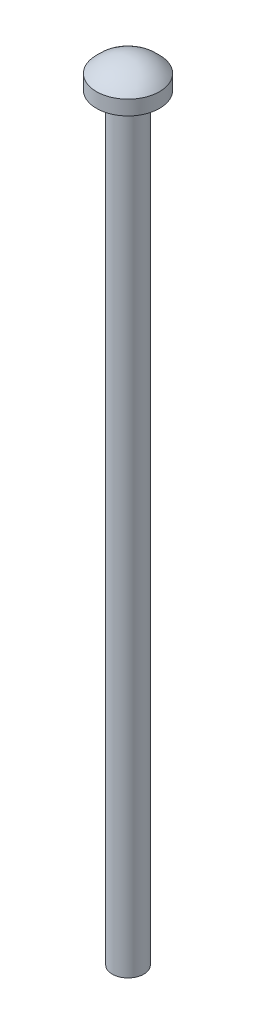
ISO-10303-21;
HEADER;
FILE_DESCRIPTION(('STEP AP214'),'2;1');
FILE_NAME('part.step','',(''),(''),'','','');
FILE_SCHEMA(('AUTOMOTIVE_DESIGN { 1 0 10303 214 1 1 1 1 }'));
ENDSEC;
DATA;
#1=APPLICATION_CONTEXT('core data for automotive mechanical design processes');
#2=APPLICATION_PROTOCOL_DEFINITION('international standard','automotive_design',2000,#1);
#3=PRODUCT_CONTEXT('',#1,'mechanical');
#4=PRODUCT('Part','Part','',(#3));
#5=PRODUCT_RELATED_PRODUCT_CATEGORY('part','',(#4));
#6=PRODUCT_DEFINITION_FORMATION('','',#4);
#7=PRODUCT_DEFINITION_CONTEXT('part definition',#1,'design');
#8=PRODUCT_DEFINITION('design','',#6,#7);
#9=PRODUCT_DEFINITION_SHAPE('','',#8);
#10=(LENGTH_UNIT() NAMED_UNIT(*) SI_UNIT(.MILLI.,.METRE.));
#11=(NAMED_UNIT(*) PLANE_ANGLE_UNIT() SI_UNIT($,.RADIAN.));
#12=(NAMED_UNIT(*) SI_UNIT($,.STERADIAN.) SOLID_ANGLE_UNIT());
#13=UNCERTAINTY_MEASURE_WITH_UNIT(LENGTH_MEASURE(1.E-05),#10,'distance_accuracy_value','');
#14=(GEOMETRIC_REPRESENTATION_CONTEXT(3) GLOBAL_UNCERTAINTY_ASSIGNED_CONTEXT((#13)) GLOBAL_UNIT_ASSIGNED_CONTEXT((#10,
#11,#12)) REPRESENTATION_CONTEXT('',''));
#15=CARTESIAN_POINT('',(0.,0.,0.));
#16=DIRECTION('',(0.,0.,1.));
#17=DIRECTION('',(1.,0.,0.));
#18=AXIS2_PLACEMENT_3D('',#15,#16,#17);
#19=CARTESIAN_POINT('',(0.,-49.3995287745686,0.));
#20=DIRECTION('',(0.,1.,0.));
#21=DIRECTION('',(0.,0.,1.));
#22=AXIS2_PLACEMENT_3D('',#19,#20,#21);
#23=PLANE('',#22);
#24=CARTESIAN_POINT('',(0.,-49.3995287745686,0.));
#25=DIRECTION('',(0.,-1.,0.));
#26=DIRECTION('',(0.,0.,-1.));
#27=AXIS2_PLACEMENT_3D('',#24,#25,#26);
#28=CIRCLE('',#27,1.5875);
#29=CARTESIAN_POINT('',(0.,-49.3995287745686,-1.5875));
#30=VERTEX_POINT('',#29);
#31=EDGE_CURVE('E10',#30,#30,#28,.T.);
#32=ORIENTED_EDGE('',*,*,#31,.T.);
#33=EDGE_LOOP('',(#32));
#34=FACE_BOUND('',#33,.T.);
#35=ADVANCED_FACE('F32',(#34),#23,.F.);
#36=CARTESIAN_POINT('',(0.,-49.3995287745686,0.));
#37=DIRECTION('',(0.,-1.,0.));
#38=DIRECTION('',(0.,0.,-1.));
#39=AXIS2_PLACEMENT_3D('',#36,#37,#38);
#40=CYLINDRICAL_SURFACE('',#39,1.5875);
#41=ORIENTED_EDGE('',*,*,#31,.F.);
#42=EDGE_LOOP('',(#41));
#43=FACE_BOUND('',#42,.T.);
#44=CARTESIAN_POINT('',(0.,26.8004712254314,0.));
#45=DIRECTION('',(0.,-1.,0.));
#46=DIRECTION('',(0.,0.,-1.));
#47=AXIS2_PLACEMENT_3D('',#44,#45,#46);
#48=CIRCLE('',#47,1.5875);
#49=CARTESIAN_POINT('',(0.,26.8004712254314,-1.5875));
#50=VERTEX_POINT('',#49);
#51=EDGE_CURVE('E38',#50,#50,#48,.T.);
#52=ORIENTED_EDGE('',*,*,#51,.T.);
#53=EDGE_LOOP('',(#52));
#54=FACE_BOUND('',#53,.T.);
#55=ADVANCED_FACE('F64',(#43,#54),#40,.T.);
#56=CARTESIAN_POINT('',(0.,26.8004712254314,1.5875));
#57=DIRECTION('',(0.,1.,0.));
#58=DIRECTION('',(0.,0.,1.));
#59=AXIS2_PLACEMENT_3D('',#56,#57,#58);
#60=PLANE('',#59);
#61=ORIENTED_EDGE('',*,*,#51,.F.);
#62=EDGE_LOOP('',(#61));
#63=FACE_BOUND('',#62,.T.);
#64=CARTESIAN_POINT('',(0.,26.8004712254314,0.));
#65=DIRECTION('',(0.,-1.,0.));
#66=DIRECTION('',(0.,0.,-1.));
#67=AXIS2_PLACEMENT_3D('',#64,#65,#66);
#68=CIRCLE('',#67,3.175);
#69=CARTESIAN_POINT('',(0.,26.8004712254314,-3.175));
#70=VERTEX_POINT('',#69);
#71=EDGE_CURVE('E42',#70,#70,#68,.T.);
#72=ORIENTED_EDGE('',*,*,#71,.T.);
#73=EDGE_LOOP('',(#72));
#74=FACE_BOUND('',#73,.T.);
#75=ADVANCED_FACE('F60',(#63,#74),#60,.F.);
#76=CARTESIAN_POINT('',(0.,-49.3995287745686,0.));
#77=DIRECTION('',(0.,-1.,0.));
#78=DIRECTION('',(0.,0.,-1.));
#79=AXIS2_PLACEMENT_3D('',#76,#77,#78);
#80=CYLINDRICAL_SURFACE('',#79,3.175);
#81=ORIENTED_EDGE('',*,*,#71,.F.);
#82=EDGE_LOOP('',(#81));
#83=FACE_BOUND('',#82,.T.);
#84=CARTESIAN_POINT('',(0.,28.26341641736,0.));
#85=DIRECTION('',(0.,-1.,0.));
#86=DIRECTION('',(0.,0.,-1.));
#87=AXIS2_PLACEMENT_3D('',#84,#85,#86);
#88=CIRCLE('',#87,3.175);
#89=CARTESIAN_POINT('',(0.,28.26341641736,-3.175));
#90=VERTEX_POINT('',#89);
#91=EDGE_CURVE('E46',#90,#90,#88,.T.);
#92=ORIENTED_EDGE('',*,*,#91,.T.);
#93=EDGE_LOOP('',(#92));
#94=FACE_BOUND('',#93,.T.);
#95=ADVANCED_FACE('F52',(#83,#94),#80,.T.);
#96=CARTESIAN_POINT('',(0.,25.5495702633063,0.));
#97=DIRECTION('',(0.,-1.,0.));
#98=DIRECTION('',(0.,0.,1.));
#99=AXIS2_PLACEMENT_3D('',#96,#97,#98);
#100=SPHERICAL_SURFACE('',#99,4.1767913459822);
#101=ORIENTED_EDGE('',*,*,#91,.F.);
#102=EDGE_LOOP('',(#101));
#103=FACE_BOUND('',#102,.T.);
#104=ADVANCED_FACE('F54',(#103),#100,.T.);
#105=CLOSED_SHELL('',(#35,#55,#75,#95,#104));
#106=MANIFOLD_SOLID_BREP('B2',#105);
#107=ADVANCED_BREP_SHAPE_REPRESENTATION('',(#18,#106),#14);
#108=SHAPE_DEFINITION_REPRESENTATION(#9,#107);
ENDSEC;
END-ISO-10303-21;
